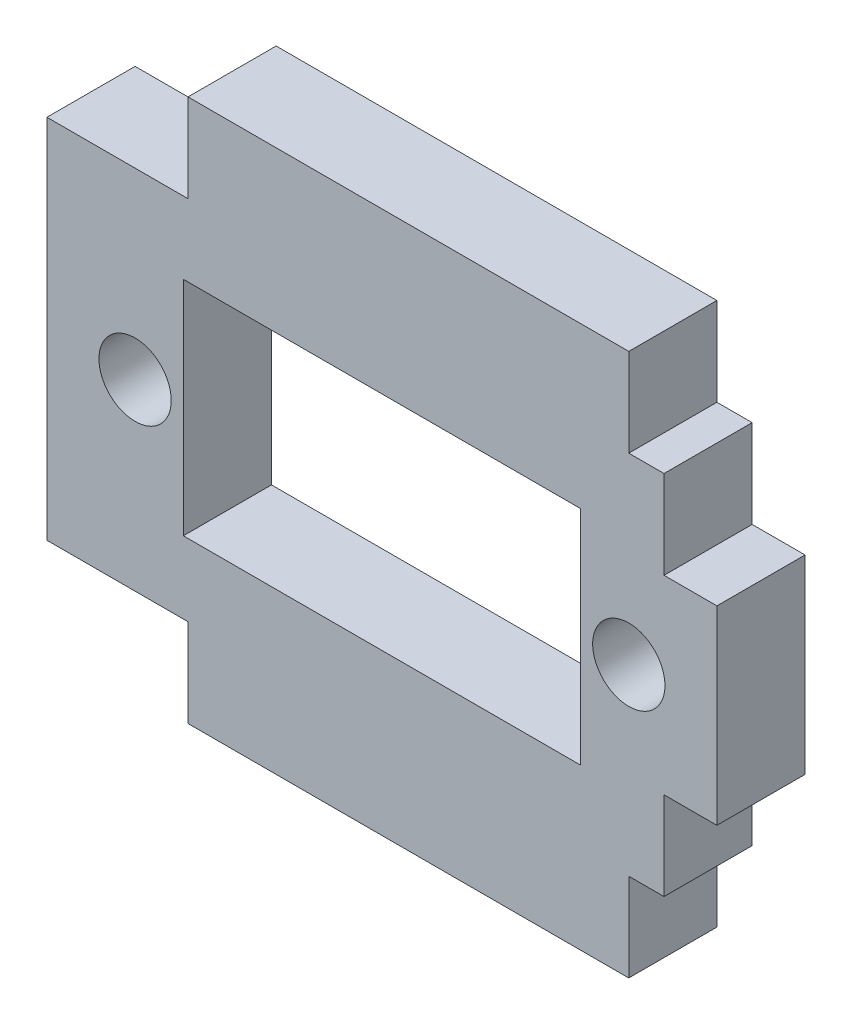
ISO-10303-21;
HEADER;
FILE_DESCRIPTION(('STEP AP214'),'2;1');
FILE_NAME('part.step','',(''),(''),'','','');
FILE_SCHEMA(('AUTOMOTIVE_DESIGN { 1 0 10303 214 1 1 1 1 }'));
ENDSEC;
DATA;
#1=APPLICATION_CONTEXT('core data for automotive mechanical design processes');
#2=APPLICATION_PROTOCOL_DEFINITION('international standard','automotive_design',2000,#1);
#3=PRODUCT_CONTEXT('',#1,'mechanical');
#4=PRODUCT('Part','Part','',(#3));
#5=PRODUCT_RELATED_PRODUCT_CATEGORY('part','',(#4));
#6=PRODUCT_DEFINITION_FORMATION('','',#4);
#7=PRODUCT_DEFINITION_CONTEXT('part definition',#1,'design');
#8=PRODUCT_DEFINITION('design','',#6,#7);
#9=PRODUCT_DEFINITION_SHAPE('','',#8);
#10=(LENGTH_UNIT() NAMED_UNIT(*) SI_UNIT(.MILLI.,.METRE.));
#11=(NAMED_UNIT(*) PLANE_ANGLE_UNIT() SI_UNIT($,.RADIAN.));
#12=(NAMED_UNIT(*) SI_UNIT($,.STERADIAN.) SOLID_ANGLE_UNIT());
#13=UNCERTAINTY_MEASURE_WITH_UNIT(LENGTH_MEASURE(1.E-05),#10,'distance_accuracy_value','');
#14=(GEOMETRIC_REPRESENTATION_CONTEXT(3) GLOBAL_UNCERTAINTY_ASSIGNED_CONTEXT((#13)) GLOBAL_UNIT_ASSIGNED_CONTEXT((#10,
#11,#12)) REPRESENTATION_CONTEXT('',''));
#15=CARTESIAN_POINT('',(0.,0.,0.));
#16=DIRECTION('',(0.,0.,1.));
#17=DIRECTION('',(1.,0.,0.));
#18=AXIS2_PLACEMENT_3D('',#15,#16,#17);
#19=CARTESIAN_POINT('',(0.,-10.39,5.));
#20=DIRECTION('',(0.,-1.,0.));
#21=DIRECTION('',(1.,0.,0.));
#22=AXIS2_PLACEMENT_3D('',#19,#20,#21);
#23=PLANE('',#22);
#24=DIRECTION('',(-1.,0.,0.));
#25=VECTOR('',#24,1.);
#26=CARTESIAN_POINT('',(0.,-10.39,0.));
#27=LINE('',#26,#25);
#28=CARTESIAN_POINT('',(-12.5,-10.39,0.));
#29=VERTEX_POINT('',#28);
#30=CARTESIAN_POINT('',(-20.5,-10.39,0.));
#31=VERTEX_POINT('',#30);
#32=EDGE_CURVE('E240',#29,#31,#27,.T.);
#33=ORIENTED_EDGE('',*,*,#32,.F.);
#34=DIRECTION('',(0.,0.,-1.));
#35=VECTOR('',#34,1.);
#36=CARTESIAN_POINT('',(-12.5,-10.39,5.));
#37=LINE('',#36,#35);
#38=CARTESIAN_POINT('',(-12.5,-10.39,5.));
#39=VERTEX_POINT('',#38);
#40=EDGE_CURVE('E11',#39,#29,#37,.T.);
#41=ORIENTED_EDGE('',*,*,#40,.F.);
#42=DIRECTION('',(-1.,0.,0.));
#43=VECTOR('',#42,1.);
#44=CARTESIAN_POINT('',(0.,-10.39,5.));
#45=LINE('',#44,#43);
#46=CARTESIAN_POINT('',(-20.5,-10.39,5.));
#47=VERTEX_POINT('',#46);
#48=EDGE_CURVE('E198',#39,#47,#45,.T.);
#49=ORIENTED_EDGE('',*,*,#48,.T.);
#50=DIRECTION('',(0.,0.,-1.));
#51=VECTOR('',#50,1.);
#52=CARTESIAN_POINT('',(-20.5,-10.39,5.));
#53=LINE('',#52,#51);
#54=EDGE_CURVE('E239',#47,#31,#53,.T.);
#55=ORIENTED_EDGE('',*,*,#54,.T.);
#56=EDGE_LOOP('',(#33,#41,#49,#55));
#57=FACE_BOUND('',#56,.T.);
#58=ADVANCED_FACE('F38',(#57),#23,.T.);
#59=CARTESIAN_POINT('',(-12.5,0.,5.));
#60=DIRECTION('',(-1.,0.,0.));
#61=DIRECTION('',(0.,-1.,0.));
#62=AXIS2_PLACEMENT_3D('',#59,#60,#61);
#63=PLANE('',#62);
#64=DIRECTION('',(0.,1.,0.));
#65=VECTOR('',#64,1.);
#66=CARTESIAN_POINT('',(-12.5,0.,0.));
#67=LINE('',#66,#65);
#68=CARTESIAN_POINT('',(-12.5,-15.39,0.));
#69=VERTEX_POINT('',#68);
#70=EDGE_CURVE('E243',#69,#29,#67,.T.);
#71=ORIENTED_EDGE('',*,*,#70,.F.);
#72=DIRECTION('',(0.,0.,-1.));
#73=VECTOR('',#72,1.);
#74=CARTESIAN_POINT('',(-12.5,-15.39,5.));
#75=LINE('',#74,#73);
#76=CARTESIAN_POINT('',(-12.5,-15.39,5.));
#77=VERTEX_POINT('',#76);
#78=EDGE_CURVE('E45',#77,#69,#75,.T.);
#79=ORIENTED_EDGE('',*,*,#78,.F.);
#80=DIRECTION('',(0.,1.,0.));
#81=VECTOR('',#80,1.);
#82=CARTESIAN_POINT('',(-12.5,0.,5.));
#83=LINE('',#82,#81);
#84=EDGE_CURVE('E201',#77,#39,#83,.T.);
#85=ORIENTED_EDGE('',*,*,#84,.T.);
#86=ORIENTED_EDGE('',*,*,#40,.T.);
#87=EDGE_LOOP('',(#71,#79,#85,#86));
#88=FACE_BOUND('',#87,.T.);
#89=ADVANCED_FACE('F324',(#88),#63,.T.);
#90=CARTESIAN_POINT('',(0.,-15.39,5.));
#91=DIRECTION('',(0.,1.,0.));
#92=DIRECTION('',(-1.,0.,0.));
#93=AXIS2_PLACEMENT_3D('',#90,#91,#92);
#94=PLANE('',#93);
#95=DIRECTION('',(1.,0.,0.));
#96=VECTOR('',#95,1.);
#97=CARTESIAN_POINT('',(0.,-15.39,0.));
#98=LINE('',#97,#96);
#99=CARTESIAN_POINT('',(12.5,-15.39,0.));
#100=VERTEX_POINT('',#99);
#101=EDGE_CURVE('E247',#69,#100,#98,.T.);
#102=ORIENTED_EDGE('',*,*,#101,.T.);
#103=DIRECTION('',(0.,0.,-1.));
#104=VECTOR('',#103,1.);
#105=CARTESIAN_POINT('',(12.5,-15.39,5.));
#106=LINE('',#105,#104);
#107=CARTESIAN_POINT('',(12.5,-15.39,5.));
#108=VERTEX_POINT('',#107);
#109=EDGE_CURVE('E312',#108,#100,#106,.T.);
#110=ORIENTED_EDGE('',*,*,#109,.F.);
#111=DIRECTION('',(1.,0.,0.));
#112=VECTOR('',#111,1.);
#113=CARTESIAN_POINT('',(0.,-15.39,5.));
#114=LINE('',#113,#112);
#115=EDGE_CURVE('E205',#77,#108,#114,.T.);
#116=ORIENTED_EDGE('',*,*,#115,.F.);
#117=ORIENTED_EDGE('',*,*,#78,.T.);
#118=EDGE_LOOP('',(#102,#110,#116,#117));
#119=FACE_BOUND('',#118,.T.);
#120=ADVANCED_FACE('F317',(#119),#94,.F.);
#121=CARTESIAN_POINT('',(12.5,0.,5.));
#122=DIRECTION('',(-1.,0.,0.));
#123=DIRECTION('',(0.,-1.,0.));
#124=AXIS2_PLACEMENT_3D('',#121,#122,#123);
#125=PLANE('',#124);
#126=DIRECTION('',(0.,1.,0.));
#127=VECTOR('',#126,1.);
#128=CARTESIAN_POINT('',(12.5,0.,0.));
#129=LINE('',#128,#127);
#130=CARTESIAN_POINT('',(12.5,-10.39,0.));
#131=VERTEX_POINT('',#130);
#132=EDGE_CURVE('E249',#100,#131,#129,.T.);
#133=ORIENTED_EDGE('',*,*,#132,.T.);
#134=DIRECTION('',(0.,0.,-1.));
#135=VECTOR('',#134,1.);
#136=CARTESIAN_POINT('',(12.5,-10.39,5.));
#137=LINE('',#136,#135);
#138=CARTESIAN_POINT('',(12.5,-10.39,5.));
#139=VERTEX_POINT('',#138);
#140=EDGE_CURVE('E309',#139,#131,#137,.T.);
#141=ORIENTED_EDGE('',*,*,#140,.F.);
#142=DIRECTION('',(0.,1.,0.));
#143=VECTOR('',#142,1.);
#144=CARTESIAN_POINT('',(12.5,0.,5.));
#145=LINE('',#144,#143);
#146=EDGE_CURVE('E207',#108,#139,#145,.T.);
#147=ORIENTED_EDGE('',*,*,#146,.F.);
#148=ORIENTED_EDGE('',*,*,#109,.T.);
#149=EDGE_LOOP('',(#133,#141,#147,#148));
#150=FACE_BOUND('',#149,.T.);
#151=ADVANCED_FACE('F384',(#150),#125,.F.);
#152=CARTESIAN_POINT('',(0.,-10.39,5.));
#153=DIRECTION('',(0.,1.,0.));
#154=DIRECTION('',(0.,0.,1.));
#155=AXIS2_PLACEMENT_3D('',#152,#153,#154);
#156=PLANE('',#155);
#157=DIRECTION('',(1.,0.,0.));
#158=VECTOR('',#157,1.);
#159=CARTESIAN_POINT('',(0.,-10.39,0.));
#160=LINE('',#159,#158);
#161=CARTESIAN_POINT('',(14.5,-10.39,0.));
#162=VERTEX_POINT('',#161);
#163=EDGE_CURVE('E251',#131,#162,#160,.T.);
#164=ORIENTED_EDGE('',*,*,#163,.T.);
#165=DIRECTION('',(0.,0.,-1.));
#166=VECTOR('',#165,1.);
#167=CARTESIAN_POINT('',(14.5,-10.39,5.));
#168=LINE('',#167,#166);
#169=CARTESIAN_POINT('',(14.5,-10.39,5.));
#170=VERTEX_POINT('',#169);
#171=EDGE_CURVE('E306',#170,#162,#168,.T.);
#172=ORIENTED_EDGE('',*,*,#171,.F.);
#173=DIRECTION('',(1.,0.,0.));
#174=VECTOR('',#173,1.);
#175=CARTESIAN_POINT('',(0.,-10.39,5.));
#176=LINE('',#175,#174);
#177=EDGE_CURVE('E209',#139,#170,#176,.T.);
#178=ORIENTED_EDGE('',*,*,#177,.F.);
#179=ORIENTED_EDGE('',*,*,#140,.T.);
#180=EDGE_LOOP('',(#164,#172,#178,#179));
#181=FACE_BOUND('',#180,.T.);
#182=ADVANCED_FACE('F379',(#181),#156,.F.);
#183=CARTESIAN_POINT('',(14.5,0.,5.));
#184=DIRECTION('',(-1.,0.,0.));
#185=DIRECTION('',(0.,0.,1.));
#186=AXIS2_PLACEMENT_3D('',#183,#184,#185);
#187=PLANE('',#186);
#188=DIRECTION('',(0.,1.,0.));
#189=VECTOR('',#188,1.);
#190=CARTESIAN_POINT('',(14.5,0.,0.));
#191=LINE('',#190,#189);
#192=CARTESIAN_POINT('',(14.5,-5.38999999999998,0.));
#193=VERTEX_POINT('',#192);
#194=EDGE_CURVE('E253',#162,#193,#191,.T.);
#195=ORIENTED_EDGE('',*,*,#194,.T.);
#196=DIRECTION('',(0.,0.,-1.));
#197=VECTOR('',#196,1.);
#198=CARTESIAN_POINT('',(14.5,-5.38999999999998,5.));
#199=LINE('',#198,#197);
#200=CARTESIAN_POINT('',(14.5,-5.38999999999998,5.));
#201=VERTEX_POINT('',#200);
#202=EDGE_CURVE('E303',#201,#193,#199,.T.);
#203=ORIENTED_EDGE('',*,*,#202,.F.);
#204=DIRECTION('',(0.,1.,0.));
#205=VECTOR('',#204,1.);
#206=CARTESIAN_POINT('',(14.5,0.,5.));
#207=LINE('',#206,#205);
#208=EDGE_CURVE('E211',#170,#201,#207,.T.);
#209=ORIENTED_EDGE('',*,*,#208,.F.);
#210=ORIENTED_EDGE('',*,*,#171,.T.);
#211=EDGE_LOOP('',(#195,#203,#209,#210));
#212=FACE_BOUND('',#211,.T.);
#213=ADVANCED_FACE('F376',(#212),#187,.F.);
#214=CARTESIAN_POINT('',(0.,-5.38999999999988,5.));
#215=DIRECTION('',(0.,1.,0.));
#216=DIRECTION('',(-1.,0.,0.));
#217=AXIS2_PLACEMENT_3D('',#214,#215,#216);
#218=PLANE('',#217);
#219=DIRECTION('',(1.,0.,0.));
#220=VECTOR('',#219,1.);
#221=CARTESIAN_POINT('',(0.,-5.38999999999988,0.));
#222=LINE('',#221,#220);
#223=CARTESIAN_POINT('',(17.5,-5.39,0.));
#224=VERTEX_POINT('',#223);
#225=EDGE_CURVE('E255',#193,#224,#222,.T.);
#226=ORIENTED_EDGE('',*,*,#225,.T.);
#227=DIRECTION('',(0.,0.,-1.));
#228=VECTOR('',#227,1.);
#229=CARTESIAN_POINT('',(17.5,-5.39,5.));
#230=LINE('',#229,#228);
#231=CARTESIAN_POINT('',(17.5,-5.39,5.));
#232=VERTEX_POINT('',#231);
#233=EDGE_CURVE('E301',#232,#224,#230,.T.);
#234=ORIENTED_EDGE('',*,*,#233,.F.);
#235=DIRECTION('',(1.,0.,0.));
#236=VECTOR('',#235,1.);
#237=CARTESIAN_POINT('',(0.,-5.38999999999988,5.));
#238=LINE('',#237,#236);
#239=EDGE_CURVE('E213',#201,#232,#238,.T.);
#240=ORIENTED_EDGE('',*,*,#239,.F.);
#241=ORIENTED_EDGE('',*,*,#202,.T.);
#242=EDGE_LOOP('',(#226,#234,#240,#241));
#243=FACE_BOUND('',#242,.T.);
#244=ADVANCED_FACE('F372',(#243),#218,.F.);
#245=CARTESIAN_POINT('',(17.5,0.,5.));
#246=DIRECTION('',(1.,0.,0.));
#247=DIRECTION('',(0.,0.,-1.));
#248=AXIS2_PLACEMENT_3D('',#245,#246,#247);
#249=PLANE('',#248);
#250=DIRECTION('',(0.,-1.,0.));
#251=VECTOR('',#250,1.);
#252=CARTESIAN_POINT('',(17.5,0.,0.));
#253=LINE('',#252,#251);
#254=CARTESIAN_POINT('',(17.5,5.39,0.));
#255=VERTEX_POINT('',#254);
#256=EDGE_CURVE('E258',#255,#224,#253,.T.);
#257=ORIENTED_EDGE('',*,*,#256,.F.);
#258=DIRECTION('',(0.,0.,-1.));
#259=VECTOR('',#258,1.);
#260=CARTESIAN_POINT('',(17.5,5.39,5.));
#261=LINE('',#260,#259);
#262=CARTESIAN_POINT('',(17.5,5.39,5.));
#263=VERTEX_POINT('',#262);
#264=EDGE_CURVE('E299',#263,#255,#261,.T.);
#265=ORIENTED_EDGE('',*,*,#264,.F.);
#266=DIRECTION('',(0.,-1.,0.));
#267=VECTOR('',#266,1.);
#268=CARTESIAN_POINT('',(17.5,0.,5.));
#269=LINE('',#268,#267);
#270=EDGE_CURVE('E215',#263,#232,#269,.T.);
#271=ORIENTED_EDGE('',*,*,#270,.T.);
#272=ORIENTED_EDGE('',*,*,#233,.T.);
#273=EDGE_LOOP('',(#257,#265,#271,#272));
#274=FACE_BOUND('',#273,.T.);
#275=ADVANCED_FACE('F367',(#274),#249,.T.);
#276=CARTESIAN_POINT('',(0.,5.39,5.));
#277=DIRECTION('',(0.,1.,0.));
#278=DIRECTION('',(0.,0.,1.));
#279=AXIS2_PLACEMENT_3D('',#276,#277,#278);
#280=PLANE('',#279);
#281=DIRECTION('',(1.,0.,0.));
#282=VECTOR('',#281,1.);
#283=CARTESIAN_POINT('',(0.,5.39,0.));
#284=LINE('',#283,#282);
#285=CARTESIAN_POINT('',(14.5,5.39,0.));
#286=VERTEX_POINT('',#285);
#287=EDGE_CURVE('E261',#286,#255,#284,.T.);
#288=ORIENTED_EDGE('',*,*,#287,.F.);
#289=DIRECTION('',(0.,0.,-1.));
#290=VECTOR('',#289,1.);
#291=CARTESIAN_POINT('',(14.5,5.39,5.));
#292=LINE('',#291,#290);
#293=CARTESIAN_POINT('',(14.5,5.39,5.));
#294=VERTEX_POINT('',#293);
#295=EDGE_CURVE('E297',#294,#286,#292,.T.);
#296=ORIENTED_EDGE('',*,*,#295,.F.);
#297=DIRECTION('',(1.,0.,0.));
#298=VECTOR('',#297,1.);
#299=CARTESIAN_POINT('',(0.,5.39,5.));
#300=LINE('',#299,#298);
#301=EDGE_CURVE('E218',#294,#263,#300,.T.);
#302=ORIENTED_EDGE('',*,*,#301,.T.);
#303=ORIENTED_EDGE('',*,*,#264,.T.);
#304=EDGE_LOOP('',(#288,#296,#302,#303));
#305=FACE_BOUND('',#304,.T.);
#306=ADVANCED_FACE('F362',(#305),#280,.T.);
#307=CARTESIAN_POINT('',(14.5,0.,5.));
#308=DIRECTION('',(1.,0.,0.));
#309=DIRECTION('',(0.,0.,-1.));
#310=AXIS2_PLACEMENT_3D('',#307,#308,#309);
#311=PLANE('',#310);
#312=DIRECTION('',(0.,-1.,0.));
#313=VECTOR('',#312,1.);
#314=CARTESIAN_POINT('',(14.5,0.,0.));
#315=LINE('',#314,#313);
#316=CARTESIAN_POINT('',(14.5,10.39,0.));
#317=VERTEX_POINT('',#316);
#318=EDGE_CURVE('E264',#317,#286,#315,.T.);
#319=ORIENTED_EDGE('',*,*,#318,.F.);
#320=DIRECTION('',(0.,0.,-1.));
#321=VECTOR('',#320,1.);
#322=CARTESIAN_POINT('',(14.5,10.39,5.));
#323=LINE('',#322,#321);
#324=CARTESIAN_POINT('',(14.5,10.39,5.));
#325=VERTEX_POINT('',#324);
#326=EDGE_CURVE('E295',#325,#317,#323,.T.);
#327=ORIENTED_EDGE('',*,*,#326,.F.);
#328=DIRECTION('',(0.,-1.,0.));
#329=VECTOR('',#328,1.);
#330=CARTESIAN_POINT('',(14.5,0.,5.));
#331=LINE('',#330,#329);
#332=EDGE_CURVE('E221',#325,#294,#331,.T.);
#333=ORIENTED_EDGE('',*,*,#332,.T.);
#334=ORIENTED_EDGE('',*,*,#295,.T.);
#335=EDGE_LOOP('',(#319,#327,#333,#334));
#336=FACE_BOUND('',#335,.T.);
#337=ADVANCED_FACE('F358',(#336),#311,.T.);
#338=CARTESIAN_POINT('',(0.,10.39,5.));
#339=DIRECTION('',(0.,1.,0.));
#340=DIRECTION('',(0.,0.,1.));
#341=AXIS2_PLACEMENT_3D('',#338,#339,#340);
#342=PLANE('',#341);
#343=DIRECTION('',(1.,0.,0.));
#344=VECTOR('',#343,1.);
#345=CARTESIAN_POINT('',(0.,10.39,0.));
#346=LINE('',#345,#344);
#347=CARTESIAN_POINT('',(12.5,10.39,0.));
#348=VERTEX_POINT('',#347);
#349=EDGE_CURVE('E267',#348,#317,#346,.T.);
#350=ORIENTED_EDGE('',*,*,#349,.F.);
#351=DIRECTION('',(0.,0.,-1.));
#352=VECTOR('',#351,1.);
#353=CARTESIAN_POINT('',(12.5,10.39,5.));
#354=LINE('',#353,#352);
#355=CARTESIAN_POINT('',(12.5,10.39,5.));
#356=VERTEX_POINT('',#355);
#357=EDGE_CURVE('E293',#356,#348,#354,.T.);
#358=ORIENTED_EDGE('',*,*,#357,.F.);
#359=DIRECTION('',(1.,0.,0.));
#360=VECTOR('',#359,1.);
#361=CARTESIAN_POINT('',(0.,10.39,5.));
#362=LINE('',#361,#360);
#363=EDGE_CURVE('E224',#356,#325,#362,.T.);
#364=ORIENTED_EDGE('',*,*,#363,.T.);
#365=ORIENTED_EDGE('',*,*,#326,.T.);
#366=EDGE_LOOP('',(#350,#358,#364,#365));
#367=FACE_BOUND('',#366,.T.);
#368=ADVANCED_FACE('F354',(#367),#342,.T.);
#369=CARTESIAN_POINT('',(12.5,0.,5.));
#370=DIRECTION('',(1.,0.,0.));
#371=DIRECTION('',(0.,0.,-1.));
#372=AXIS2_PLACEMENT_3D('',#369,#370,#371);
#373=PLANE('',#372);
#374=DIRECTION('',(0.,-1.,0.));
#375=VECTOR('',#374,1.);
#376=CARTESIAN_POINT('',(12.5,0.,0.));
#377=LINE('',#376,#375);
#378=CARTESIAN_POINT('',(12.5,15.39,0.));
#379=VERTEX_POINT('',#378);
#380=EDGE_CURVE('E270',#379,#348,#377,.T.);
#381=ORIENTED_EDGE('',*,*,#380,.F.);
#382=DIRECTION('',(0.,0.,-1.));
#383=VECTOR('',#382,1.);
#384=CARTESIAN_POINT('',(12.5,15.39,5.));
#385=LINE('',#384,#383);
#386=CARTESIAN_POINT('',(12.5,15.39,5.));
#387=VERTEX_POINT('',#386);
#388=EDGE_CURVE('E291',#387,#379,#385,.T.);
#389=ORIENTED_EDGE('',*,*,#388,.F.);
#390=DIRECTION('',(0.,-1.,0.));
#391=VECTOR('',#390,1.);
#392=CARTESIAN_POINT('',(12.5,0.,5.));
#393=LINE('',#392,#391);
#394=EDGE_CURVE('E227',#387,#356,#393,.T.);
#395=ORIENTED_EDGE('',*,*,#394,.T.);
#396=ORIENTED_EDGE('',*,*,#357,.T.);
#397=EDGE_LOOP('',(#381,#389,#395,#396));
#398=FACE_BOUND('',#397,.T.);
#399=ADVANCED_FACE('F350',(#398),#373,.T.);
#400=CARTESIAN_POINT('',(0.,15.39,5.));
#401=DIRECTION('',(0.,1.,0.));
#402=DIRECTION('',(0.,0.,1.));
#403=AXIS2_PLACEMENT_3D('',#400,#401,#402);
#404=PLANE('',#403);
#405=DIRECTION('',(1.,0.,0.));
#406=VECTOR('',#405,1.);
#407=CARTESIAN_POINT('',(0.,15.39,0.));
#408=LINE('',#407,#406);
#409=CARTESIAN_POINT('',(-12.5,15.39,0.));
#410=VERTEX_POINT('',#409);
#411=EDGE_CURVE('E273',#410,#379,#408,.T.);
#412=ORIENTED_EDGE('',*,*,#411,.F.);
#413=DIRECTION('',(0.,0.,-1.));
#414=VECTOR('',#413,1.);
#415=CARTESIAN_POINT('',(-12.5,15.39,5.));
#416=LINE('',#415,#414);
#417=CARTESIAN_POINT('',(-12.5,15.39,5.));
#418=VERTEX_POINT('',#417);
#419=EDGE_CURVE('E289',#418,#410,#416,.T.);
#420=ORIENTED_EDGE('',*,*,#419,.F.);
#421=DIRECTION('',(1.,0.,0.));
#422=VECTOR('',#421,1.);
#423=CARTESIAN_POINT('',(0.,15.39,5.));
#424=LINE('',#423,#422);
#425=EDGE_CURVE('E230',#418,#387,#424,.T.);
#426=ORIENTED_EDGE('',*,*,#425,.T.);
#427=ORIENTED_EDGE('',*,*,#388,.T.);
#428=EDGE_LOOP('',(#412,#420,#426,#427));
#429=FACE_BOUND('',#428,.T.);
#430=ADVANCED_FACE('F346',(#429),#404,.T.);
#431=CARTESIAN_POINT('',(-12.5,0.,5.));
#432=DIRECTION('',(1.,0.,0.));
#433=DIRECTION('',(0.,0.,-1.));
#434=AXIS2_PLACEMENT_3D('',#431,#432,#433);
#435=PLANE('',#434);
#436=DIRECTION('',(0.,-1.,0.));
#437=VECTOR('',#436,1.);
#438=CARTESIAN_POINT('',(-12.5,0.,0.));
#439=LINE('',#438,#437);
#440=CARTESIAN_POINT('',(-12.5,10.39,0.));
#441=VERTEX_POINT('',#440);
#442=EDGE_CURVE('E276',#410,#441,#439,.T.);
#443=ORIENTED_EDGE('',*,*,#442,.T.);
#444=DIRECTION('',(0.,0.,-1.));
#445=VECTOR('',#444,1.);
#446=CARTESIAN_POINT('',(-12.5,10.39,5.));
#447=LINE('',#446,#445);
#448=CARTESIAN_POINT('',(-12.5,10.39,5.));
#449=VERTEX_POINT('',#448);
#450=EDGE_CURVE('E286',#449,#441,#447,.T.);
#451=ORIENTED_EDGE('',*,*,#450,.F.);
#452=DIRECTION('',(0.,-1.,0.));
#453=VECTOR('',#452,1.);
#454=CARTESIAN_POINT('',(-12.5,0.,5.));
#455=LINE('',#454,#453);
#456=EDGE_CURVE('E233',#418,#449,#455,.T.);
#457=ORIENTED_EDGE('',*,*,#456,.F.);
#458=ORIENTED_EDGE('',*,*,#419,.T.);
#459=EDGE_LOOP('',(#443,#451,#457,#458));
#460=FACE_BOUND('',#459,.T.);
#461=ADVANCED_FACE('F342',(#460),#435,.F.);
#462=CARTESIAN_POINT('',(0.,10.39,5.));
#463=DIRECTION('',(0.,-1.,0.));
#464=DIRECTION('',(1.,0.,0.));
#465=AXIS2_PLACEMENT_3D('',#462,#463,#464);
#466=PLANE('',#465);
#467=DIRECTION('',(-1.,0.,0.));
#468=VECTOR('',#467,1.);
#469=CARTESIAN_POINT('',(0.,10.39,0.));
#470=LINE('',#469,#468);
#471=CARTESIAN_POINT('',(-20.5,10.39,0.));
#472=VERTEX_POINT('',#471);
#473=EDGE_CURVE('E278',#441,#472,#470,.T.);
#474=ORIENTED_EDGE('',*,*,#473,.T.);
#475=DIRECTION('',(0.,0.,-1.));
#476=VECTOR('',#475,1.);
#477=CARTESIAN_POINT('',(-20.5,10.39,5.));
#478=LINE('',#477,#476);
#479=CARTESIAN_POINT('',(-20.5,10.39,5.));
#480=VERTEX_POINT('',#479);
#481=EDGE_CURVE('E283',#480,#472,#478,.T.);
#482=ORIENTED_EDGE('',*,*,#481,.F.);
#483=DIRECTION('',(-1.,0.,0.));
#484=VECTOR('',#483,1.);
#485=CARTESIAN_POINT('',(0.,10.39,5.));
#486=LINE('',#485,#484);
#487=EDGE_CURVE('E235',#449,#480,#486,.T.);
#488=ORIENTED_EDGE('',*,*,#487,.F.);
#489=ORIENTED_EDGE('',*,*,#450,.T.);
#490=EDGE_LOOP('',(#474,#482,#488,#489));
#491=FACE_BOUND('',#490,.T.);
#492=ADVANCED_FACE('F338',(#491),#466,.F.);
#493=CARTESIAN_POINT('',(-20.5,0.,5.));
#494=DIRECTION('',(1.,0.,0.));
#495=DIRECTION('',(0.,1.,0.));
#496=AXIS2_PLACEMENT_3D('',#493,#494,#495);
#497=PLANE('',#496);
#498=DIRECTION('',(0.,-1.,0.));
#499=VECTOR('',#498,1.);
#500=CARTESIAN_POINT('',(-20.5,0.,0.));
#501=LINE('',#500,#499);
#502=EDGE_CURVE('E202',#472,#31,#501,.T.);
#503=ORIENTED_EDGE('',*,*,#502,.T.);
#504=ORIENTED_EDGE('',*,*,#54,.F.);
#505=DIRECTION('',(0.,-1.,0.));
#506=VECTOR('',#505,1.);
#507=CARTESIAN_POINT('',(-20.5,0.,5.));
#508=LINE('',#507,#506);
#509=EDGE_CURVE('E237',#480,#47,#508,.T.);
#510=ORIENTED_EDGE('',*,*,#509,.F.);
#511=ORIENTED_EDGE('',*,*,#481,.T.);
#512=EDGE_LOOP('',(#503,#504,#510,#511));
#513=FACE_BOUND('',#512,.T.);
#514=ADVANCED_FACE('F333',(#513),#497,.F.);
#515=CARTESIAN_POINT('',(0.,0.,5.));
#516=DIRECTION('',(0.,0.,1.));
#517=DIRECTION('',(1.,0.,0.));
#518=AXIS2_PLACEMENT_3D('',#515,#516,#517);
#519=PLANE('',#518);
#520=CARTESIAN_POINT('',(-15.5,0.,5.));
#521=DIRECTION('',(0.,0.,1.));
#522=DIRECTION('',(1.,0.,0.));
#523=AXIS2_PLACEMENT_3D('',#520,#521,#522);
#524=CIRCLE('',#523,2.04999999999999);
#525=CARTESIAN_POINT('',(-13.45,0.,5.));
#526=VERTEX_POINT('',#525);
#527=EDGE_CURVE('E638',#526,#526,#524,.T.);
#528=ORIENTED_EDGE('',*,*,#527,.F.);
#529=EDGE_LOOP('',(#528));
#530=FACE_BOUND('',#529,.T.);
#531=CARTESIAN_POINT('',(12.5035,0.,5.));
#532=DIRECTION('',(0.,0.,1.));
#533=DIRECTION('',(1.,0.,0.));
#534=AXIS2_PLACEMENT_3D('',#531,#532,#533);
#535=CIRCLE('',#534,2.05);
#536=CARTESIAN_POINT('',(14.5535,0.,5.));
#537=VERTEX_POINT('',#536);
#538=EDGE_CURVE('E642',#537,#537,#535,.T.);
#539=ORIENTED_EDGE('',*,*,#538,.F.);
#540=EDGE_LOOP('',(#539));
#541=FACE_BOUND('',#540,.T.);
#542=DIRECTION('',(0.,-1.,0.));
#543=VECTOR('',#542,1.);
#544=CARTESIAN_POINT('',(-12.76335,-6.3,5.));
#545=LINE('',#544,#543);
#546=CARTESIAN_POINT('',(-12.76335,6.3,5.));
#547=VERTEX_POINT('',#546);
#548=CARTESIAN_POINT('',(-12.76335,-6.3,5.));
#549=VERTEX_POINT('',#548);
#550=EDGE_CURVE('E52',#547,#549,#545,.T.);
#551=ORIENTED_EDGE('',*,*,#550,.F.);
#552=DIRECTION('',(-1.,0.,0.));
#553=VECTOR('',#552,1.);
#554=CARTESIAN_POINT('',(-12.76335,6.3,5.));
#555=LINE('',#554,#553);
#556=CARTESIAN_POINT('',(9.76664999999998,6.3,5.));
#557=VERTEX_POINT('',#556);
#558=EDGE_CURVE('E179',#557,#547,#555,.T.);
#559=ORIENTED_EDGE('',*,*,#558,.F.);
#560=DIRECTION('',(0.,1.,0.));
#561=VECTOR('',#560,1.);
#562=CARTESIAN_POINT('',(9.76664999999998,-6.3,5.));
#563=LINE('',#562,#561);
#564=CARTESIAN_POINT('',(9.76664999999998,-6.3,5.));
#565=VERTEX_POINT('',#564);
#566=EDGE_CURVE('E655',#565,#557,#563,.T.);
#567=ORIENTED_EDGE('',*,*,#566,.F.);
#568=DIRECTION('',(1.,0.,0.));
#569=VECTOR('',#568,1.);
#570=CARTESIAN_POINT('',(-12.76335,-6.3,5.));
#571=LINE('',#570,#569);
#572=EDGE_CURVE('E658',#549,#565,#571,.T.);
#573=ORIENTED_EDGE('',*,*,#572,.F.);
#574=EDGE_LOOP('',(#551,#559,#567,#573));
#575=FACE_BOUND('',#574,.T.);
#576=ORIENTED_EDGE('',*,*,#48,.F.);
#577=ORIENTED_EDGE('',*,*,#84,.F.);
#578=ORIENTED_EDGE('',*,*,#115,.T.);
#579=ORIENTED_EDGE('',*,*,#146,.T.);
#580=ORIENTED_EDGE('',*,*,#177,.T.);
#581=ORIENTED_EDGE('',*,*,#208,.T.);
#582=ORIENTED_EDGE('',*,*,#239,.T.);
#583=ORIENTED_EDGE('',*,*,#270,.F.);
#584=ORIENTED_EDGE('',*,*,#301,.F.);
#585=ORIENTED_EDGE('',*,*,#332,.F.);
#586=ORIENTED_EDGE('',*,*,#363,.F.);
#587=ORIENTED_EDGE('',*,*,#394,.F.);
#588=ORIENTED_EDGE('',*,*,#425,.F.);
#589=ORIENTED_EDGE('',*,*,#456,.T.);
#590=ORIENTED_EDGE('',*,*,#487,.T.);
#591=ORIENTED_EDGE('',*,*,#509,.T.);
#592=EDGE_LOOP('',(#576,#577,#578,#579,#580,#581,#582,#583,#584,#585,#586,#587,#588,#589,#590,#591));
#593=FACE_BOUND('',#592,.T.);
#594=ADVANCED_FACE('F386',(#530,#541,#575,#593),#519,.T.);
#595=CARTESIAN_POINT('',(0.,0.,0.));
#596=DIRECTION('',(0.,0.,1.));
#597=DIRECTION('',(1.,0.,0.));
#598=AXIS2_PLACEMENT_3D('',#595,#596,#597);
#599=PLANE('',#598);
#600=CARTESIAN_POINT('',(-15.5,0.,0.));
#601=DIRECTION('',(0.,0.,1.));
#602=DIRECTION('',(1.,0.,0.));
#603=AXIS2_PLACEMENT_3D('',#600,#601,#602);
#604=CIRCLE('',#603,2.04999999999999);
#605=CARTESIAN_POINT('',(-13.45,0.,0.));
#606=VERTEX_POINT('',#605);
#607=EDGE_CURVE('E244',#606,#606,#604,.F.);
#608=ORIENTED_EDGE('',*,*,#607,.F.);
#609=EDGE_LOOP('',(#608));
#610=FACE_BOUND('',#609,.T.);
#611=CARTESIAN_POINT('',(12.5035,0.,0.));
#612=DIRECTION('',(0.,0.,1.));
#613=DIRECTION('',(1.,0.,0.));
#614=AXIS2_PLACEMENT_3D('',#611,#612,#613);
#615=CIRCLE('',#614,2.05);
#616=CARTESIAN_POINT('',(14.5535,0.,0.));
#617=VERTEX_POINT('',#616);
#618=EDGE_CURVE('E194',#617,#617,#615,.F.);
#619=ORIENTED_EDGE('',*,*,#618,.F.);
#620=EDGE_LOOP('',(#619));
#621=FACE_BOUND('',#620,.T.);
#622=DIRECTION('',(1.,0.,0.));
#623=VECTOR('',#622,1.);
#624=CARTESIAN_POINT('',(-12.76335,6.3,0.));
#625=LINE('',#624,#623);
#626=CARTESIAN_POINT('',(-12.76335,6.3,0.));
#627=VERTEX_POINT('',#626);
#628=CARTESIAN_POINT('',(9.76664999999998,6.3,0.));
#629=VERTEX_POINT('',#628);
#630=EDGE_CURVE('E177',#627,#629,#625,.T.);
#631=ORIENTED_EDGE('',*,*,#630,.F.);
#632=DIRECTION('',(0.,1.,0.));
#633=VECTOR('',#632,1.);
#634=CARTESIAN_POINT('',(-12.76335,-6.3,0.));
#635=LINE('',#634,#633);
#636=CARTESIAN_POINT('',(-12.76335,-6.3,0.));
#637=VERTEX_POINT('',#636);
#638=EDGE_CURVE('E184',#637,#627,#635,.T.);
#639=ORIENTED_EDGE('',*,*,#638,.F.);
#640=DIRECTION('',(-1.,0.,0.));
#641=VECTOR('',#640,1.);
#642=CARTESIAN_POINT('',(-12.76335,-6.3,0.));
#643=LINE('',#642,#641);
#644=CARTESIAN_POINT('',(9.76664999999998,-6.3,0.));
#645=VERTEX_POINT('',#644);
#646=EDGE_CURVE('E181',#645,#637,#643,.T.);
#647=ORIENTED_EDGE('',*,*,#646,.F.);
#648=DIRECTION('',(0.,-1.,0.));
#649=VECTOR('',#648,1.);
#650=CARTESIAN_POINT('',(9.76664999999998,-6.3,0.));
#651=LINE('',#650,#649);
#652=EDGE_CURVE('E60',#629,#645,#651,.T.);
#653=ORIENTED_EDGE('',*,*,#652,.F.);
#654=EDGE_LOOP('',(#631,#639,#647,#653));
#655=FACE_BOUND('',#654,.T.);
#656=ORIENTED_EDGE('',*,*,#32,.T.);
#657=ORIENTED_EDGE('',*,*,#502,.F.);
#658=ORIENTED_EDGE('',*,*,#473,.F.);
#659=ORIENTED_EDGE('',*,*,#442,.F.);
#660=ORIENTED_EDGE('',*,*,#411,.T.);
#661=ORIENTED_EDGE('',*,*,#380,.T.);
#662=ORIENTED_EDGE('',*,*,#349,.T.);
#663=ORIENTED_EDGE('',*,*,#318,.T.);
#664=ORIENTED_EDGE('',*,*,#287,.T.);
#665=ORIENTED_EDGE('',*,*,#256,.T.);
#666=ORIENTED_EDGE('',*,*,#225,.F.);
#667=ORIENTED_EDGE('',*,*,#194,.F.);
#668=ORIENTED_EDGE('',*,*,#163,.F.);
#669=ORIENTED_EDGE('',*,*,#132,.F.);
#670=ORIENTED_EDGE('',*,*,#101,.F.);
#671=ORIENTED_EDGE('',*,*,#70,.T.);
#672=EDGE_LOOP('',(#656,#657,#658,#659,#660,#661,#662,#663,#664,#665,#666,#667,#668,#669,#670,#671));
#673=FACE_BOUND('',#672,.T.);
#674=ADVANCED_FACE('F191',(#610,#621,#655,#673),#599,.F.);
#675=CARTESIAN_POINT('',(-12.76335,-6.3,-0.00100000000000013));
#676=DIRECTION('',(-1.,0.,0.));
#677=DIRECTION('',(0.,0.,1.));
#678=AXIS2_PLACEMENT_3D('',#675,#676,#677);
#679=PLANE('',#678);
#680=ORIENTED_EDGE('',*,*,#638,.T.);
#681=DIRECTION('',(0.,0.,1.));
#682=VECTOR('',#681,1.);
#683=CARTESIAN_POINT('',(-12.76335,6.3,-0.00100000000000013));
#684=LINE('',#683,#682);
#685=EDGE_CURVE('E173',#627,#547,#684,.T.);
#686=ORIENTED_EDGE('',*,*,#685,.T.);
#687=ORIENTED_EDGE('',*,*,#550,.T.);
#688=DIRECTION('',(0.,0.,1.));
#689=VECTOR('',#688,1.);
#690=CARTESIAN_POINT('',(-12.76335,-6.3,-0.00100000000000013));
#691=LINE('',#690,#689);
#692=EDGE_CURVE('E186',#637,#549,#691,.T.);
#693=ORIENTED_EDGE('',*,*,#692,.F.);
#694=EDGE_LOOP('',(#680,#686,#687,#693));
#695=FACE_BOUND('',#694,.T.);
#696=ADVANCED_FACE('F185',(#695),#679,.F.);
#697=CARTESIAN_POINT('',(-12.76335,6.3,-0.00100000000000013));
#698=DIRECTION('',(0.,1.,0.));
#699=DIRECTION('',(0.,0.,1.));
#700=AXIS2_PLACEMENT_3D('',#697,#698,#699);
#701=PLANE('',#700);
#702=ORIENTED_EDGE('',*,*,#630,.T.);
#703=DIRECTION('',(0.,0.,1.));
#704=VECTOR('',#703,1.);
#705=CARTESIAN_POINT('',(9.76664999999998,6.3,-0.00100000000000013));
#706=LINE('',#705,#704);
#707=EDGE_CURVE('E180',#629,#557,#706,.T.);
#708=ORIENTED_EDGE('',*,*,#707,.T.);
#709=ORIENTED_EDGE('',*,*,#558,.T.);
#710=ORIENTED_EDGE('',*,*,#685,.F.);
#711=EDGE_LOOP('',(#702,#708,#709,#710));
#712=FACE_BOUND('',#711,.T.);
#713=ADVANCED_FACE('F175',(#712),#701,.F.);
#714=CARTESIAN_POINT('',(9.76664999999998,-6.3,-0.00100000000000013));
#715=DIRECTION('',(1.,0.,0.));
#716=DIRECTION('',(0.,0.,-1.));
#717=AXIS2_PLACEMENT_3D('',#714,#715,#716);
#718=PLANE('',#717);
#719=ORIENTED_EDGE('',*,*,#652,.T.);
#720=DIRECTION('',(0.,0.,1.));
#721=VECTOR('',#720,1.);
#722=CARTESIAN_POINT('',(9.76664999999998,-6.3,-0.00100000000000013));
#723=LINE('',#722,#721);
#724=EDGE_CURVE('E651',#645,#565,#723,.T.);
#725=ORIENTED_EDGE('',*,*,#724,.T.);
#726=ORIENTED_EDGE('',*,*,#566,.T.);
#727=ORIENTED_EDGE('',*,*,#707,.F.);
#728=EDGE_LOOP('',(#719,#725,#726,#727));
#729=FACE_BOUND('',#728,.T.);
#730=ADVANCED_FACE('F471',(#729),#718,.F.);
#731=CARTESIAN_POINT('',(-12.76335,-6.3,-0.00100000000000013));
#732=DIRECTION('',(0.,-1.,0.));
#733=DIRECTION('',(0.,0.,-1.));
#734=AXIS2_PLACEMENT_3D('',#731,#732,#733);
#735=PLANE('',#734);
#736=ORIENTED_EDGE('',*,*,#646,.T.);
#737=ORIENTED_EDGE('',*,*,#692,.T.);
#738=ORIENTED_EDGE('',*,*,#572,.T.);
#739=ORIENTED_EDGE('',*,*,#724,.F.);
#740=EDGE_LOOP('',(#736,#737,#738,#739));
#741=FACE_BOUND('',#740,.T.);
#742=ADVANCED_FACE('F480',(#741),#735,.F.);
#743=CARTESIAN_POINT('',(12.5035,0.,-0.00100000000000013));
#744=DIRECTION('',(0.,0.,1.));
#745=DIRECTION('',(1.,0.,0.));
#746=AXIS2_PLACEMENT_3D('',#743,#744,#745);
#747=CYLINDRICAL_SURFACE('',#746,2.05);
#748=ORIENTED_EDGE('',*,*,#538,.T.);
#749=EDGE_LOOP('',(#748));
#750=FACE_BOUND('',#749,.T.);
#751=ORIENTED_EDGE('',*,*,#618,.T.);
#752=EDGE_LOOP('',(#751));
#753=FACE_BOUND('',#752,.T.);
#754=ADVANCED_FACE('F490',(#750,#753),#747,.F.);
#755=CARTESIAN_POINT('',(-15.5,0.,-0.00100000000000013));
#756=DIRECTION('',(0.,0.,1.));
#757=DIRECTION('',(1.,0.,0.));
#758=AXIS2_PLACEMENT_3D('',#755,#756,#757);
#759=CYLINDRICAL_SURFACE('',#758,2.04999999999999);
#760=ORIENTED_EDGE('',*,*,#527,.T.);
#761=EDGE_LOOP('',(#760));
#762=FACE_BOUND('',#761,.T.);
#763=ORIENTED_EDGE('',*,*,#607,.T.);
#764=EDGE_LOOP('',(#763));
#765=FACE_BOUND('',#764,.T.);
#766=ADVANCED_FACE('F501',(#762,#765),#759,.F.);
#767=CLOSED_SHELL('',(#58,#89,#120,#151,#182,#213,#244,#275,#306,#337,#368,#399,#430,#461,#492,
#514,#594,#674,#696,#713,#730,#742,#754,#766));
#768=MANIFOLD_SOLID_BREP('B2',#767);
#769=ADVANCED_BREP_SHAPE_REPRESENTATION('',(#18,#768),#14);
#770=SHAPE_DEFINITION_REPRESENTATION(#9,#769);
ENDSEC;
END-ISO-10303-21;
